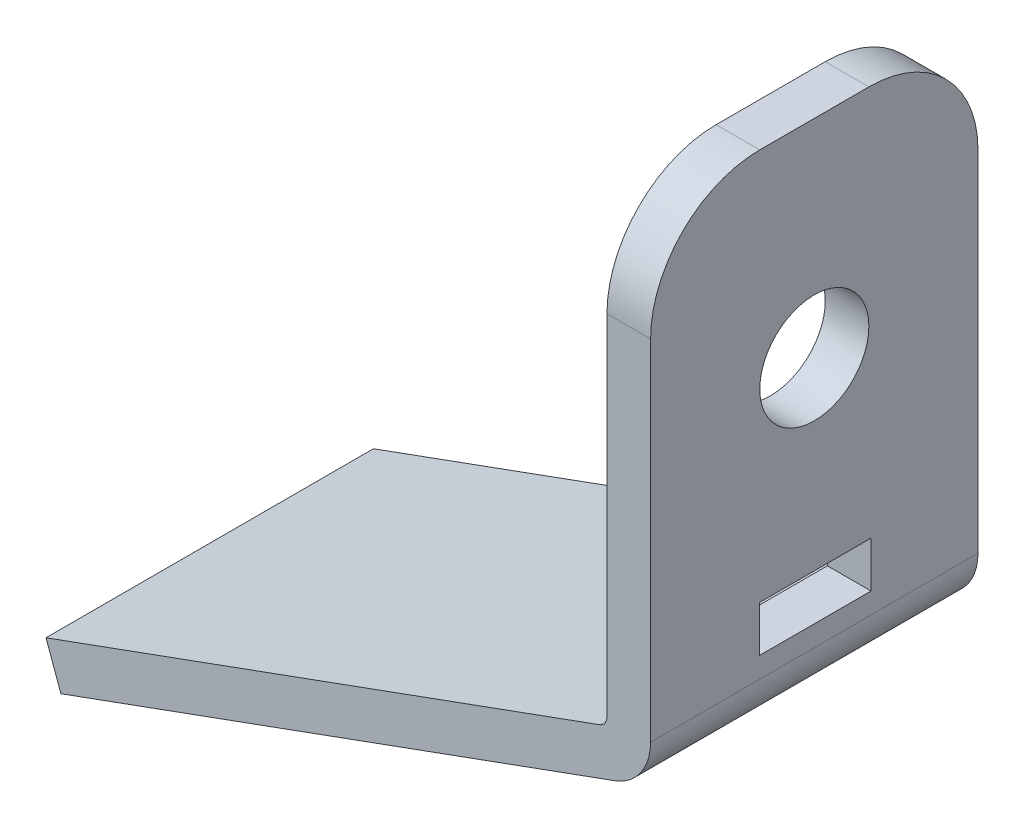
ISO-10303-21;
HEADER;
FILE_DESCRIPTION(('STEP AP214'),'2;1');
FILE_NAME('part.step','',(''),(''),'','','');
FILE_SCHEMA(('AUTOMOTIVE_DESIGN { 1 0 10303 214 1 1 1 1 }'));
ENDSEC;
DATA;
#1=APPLICATION_CONTEXT('core data for automotive mechanical design processes');
#2=APPLICATION_PROTOCOL_DEFINITION('international standard','automotive_design',2000,#1);
#3=PRODUCT_CONTEXT('',#1,'mechanical');
#4=PRODUCT('Part','Part','',(#3));
#5=PRODUCT_RELATED_PRODUCT_CATEGORY('part','',(#4));
#6=PRODUCT_DEFINITION_FORMATION('','',#4);
#7=PRODUCT_DEFINITION_CONTEXT('part definition',#1,'design');
#8=PRODUCT_DEFINITION('design','',#6,#7);
#9=PRODUCT_DEFINITION_SHAPE('','',#8);
#10=(LENGTH_UNIT() NAMED_UNIT(*) SI_UNIT(.MILLI.,.METRE.));
#11=(NAMED_UNIT(*) PLANE_ANGLE_UNIT() SI_UNIT($,.RADIAN.));
#12=(NAMED_UNIT(*) SI_UNIT($,.STERADIAN.) SOLID_ANGLE_UNIT());
#13=UNCERTAINTY_MEASURE_WITH_UNIT(LENGTH_MEASURE(1.E-05),#10,'distance_accuracy_value','');
#14=(GEOMETRIC_REPRESENTATION_CONTEXT(3) GLOBAL_UNCERTAINTY_ASSIGNED_CONTEXT((#13)) GLOBAL_UNIT_ASSIGNED_CONTEXT((#10,
#11,#12)) REPRESENTATION_CONTEXT('',''));
#15=CARTESIAN_POINT('',(0.,0.,0.));
#16=DIRECTION('',(0.,0.,1.));
#17=DIRECTION('',(1.,0.,0.));
#18=AXIS2_PLACEMENT_3D('',#15,#16,#17);
#19=CARTESIAN_POINT('',(2.00000000000001,-376.322980187255,-15.));
#20=DIRECTION('',(1.,0.,0.));
#21=DIRECTION('',(0.,0.,-1.));
#22=AXIS2_PLACEMENT_3D('',#19,#20,#21);
#23=PLANE('',#22);
#24=DIRECTION('',(0.,0.,-1.));
#25=VECTOR('',#24,1.);
#26=CARTESIAN_POINT('',(2.00000000000001,-375.372980187255,-10.1));
#27=LINE('',#26,#25);
#28=CARTESIAN_POINT('',(2.00000000000001,-375.372980187255,-5.));
#29=VERTEX_POINT('',#28);
#30=CARTESIAN_POINT('',(2.00000000000001,-375.372980187255,-10.1));
#31=VERTEX_POINT('',#30);
#32=EDGE_CURVE('E157',#29,#31,#27,.T.);
#33=ORIENTED_EDGE('',*,*,#32,.F.);
#34=DIRECTION('',(0.,-1.,0.));
#35=VECTOR('',#34,1.);
#36=CARTESIAN_POINT('',(2.00000000000001,-373.272980187255,-5.));
#37=LINE('',#36,#35);
#38=CARTESIAN_POINT('',(2.00000000000001,-373.272980187255,-5.));
#39=VERTEX_POINT('',#38);
#40=EDGE_CURVE('E161',#39,#29,#37,.T.);
#41=ORIENTED_EDGE('',*,*,#40,.F.);
#42=DIRECTION('',(0.,0.,1.));
#43=VECTOR('',#42,1.);
#44=CARTESIAN_POINT('',(2.00000000000001,-373.272980187255,-10.1));
#45=LINE('',#44,#43);
#46=CARTESIAN_POINT('',(2.00000000000001,-373.272980187255,-10.1));
#47=VERTEX_POINT('',#46);
#48=EDGE_CURVE('E141',#47,#39,#45,.T.);
#49=ORIENTED_EDGE('',*,*,#48,.F.);
#50=DIRECTION('',(0.,1.,0.));
#51=VECTOR('',#50,1.);
#52=CARTESIAN_POINT('',(2.00000000000001,-375.372980187255,-10.1));
#53=LINE('',#52,#51);
#54=EDGE_CURVE('E152',#31,#47,#53,.T.);
#55=ORIENTED_EDGE('',*,*,#54,.F.);
#56=EDGE_LOOP('',(#33,#41,#49,#55));
#57=FACE_BOUND('',#56,.T.);
#58=CARTESIAN_POINT('',(2.00000000000001,-364.820100819106,-7.5));
#59=DIRECTION('',(1.,0.,0.));
#60=DIRECTION('',(0.,0.,-1.));
#61=AXIS2_PLACEMENT_3D('',#58,#59,#60);
#62=CIRCLE('',#61,2.5);
#63=CARTESIAN_POINT('',(2.00000000000001,-364.820100819106,-10.));
#64=VERTEX_POINT('',#63);
#65=EDGE_CURVE('E168',#64,#64,#62,.T.);
#66=ORIENTED_EDGE('',*,*,#65,.F.);
#67=EDGE_LOOP('',(#66));
#68=FACE_BOUND('',#67,.T.);
#69=DIRECTION('',(0.,0.,1.));
#70=VECTOR('',#69,1.);
#71=CARTESIAN_POINT('',(2.00000000000001,-355.320100819106,-15.));
#72=LINE('',#71,#70);
#73=CARTESIAN_POINT('',(2.00000000000001,-355.320100819106,-10.));
#74=VERTEX_POINT('',#73);
#75=CARTESIAN_POINT('',(2.00000000000001,-355.320100819106,-5.));
#76=VERTEX_POINT('',#75);
#77=EDGE_CURVE('E194',#74,#76,#72,.T.);
#78=ORIENTED_EDGE('',*,*,#77,.T.);
#79=CARTESIAN_POINT('',(2.00000000000001,-360.320100819106,-5.));
#80=DIRECTION('',(1.,0.,0.));
#81=DIRECTION('',(0.,0.,-1.));
#82=AXIS2_PLACEMENT_3D('',#79,#80,#81);
#83=CIRCLE('',#82,5.);
#84=CARTESIAN_POINT('',(2.00000000000001,-360.320100819106,0.));
#85=VERTEX_POINT('',#84);
#86=EDGE_CURVE('E42',#76,#85,#83,.T.);
#87=ORIENTED_EDGE('',*,*,#86,.T.);
#88=DIRECTION('',(0.,1.,0.));
#89=VECTOR('',#88,1.);
#90=CARTESIAN_POINT('',(2.00000000000001,-376.322980187255,0.));
#91=LINE('',#90,#89);
#92=CARTESIAN_POINT('',(2.00000000000002,-376.322980187255,0.));
#93=VERTEX_POINT('',#92);
#94=EDGE_CURVE('E177',#93,#85,#91,.T.);
#95=ORIENTED_EDGE('',*,*,#94,.F.);
#96=DIRECTION('',(0.,0.,1.));
#97=VECTOR('',#96,1.);
#98=CARTESIAN_POINT('',(2.00000000000002,-376.322980187255,-15.));
#99=LINE('',#98,#97);
#100=CARTESIAN_POINT('',(2.00000000000002,-376.322980187255,-15.));
#101=VERTEX_POINT('',#100);
#102=EDGE_CURVE('E214',#101,#93,#99,.T.);
#103=ORIENTED_EDGE('',*,*,#102,.F.);
#104=DIRECTION('',(0.,1.,0.));
#105=VECTOR('',#104,1.);
#106=CARTESIAN_POINT('',(2.00000000000001,-375.320100819106,-15.));
#107=LINE('',#106,#105);
#108=CARTESIAN_POINT('',(2.00000000000001,-360.320100819106,-15.));
#109=VERTEX_POINT('',#108);
#110=EDGE_CURVE('E174',#101,#109,#107,.T.);
#111=ORIENTED_EDGE('',*,*,#110,.T.);
#112=CARTESIAN_POINT('',(2.00000000000001,-360.320100819106,-10.));
#113=DIRECTION('',(1.,0.,0.));
#114=DIRECTION('',(0.,0.,-1.));
#115=AXIS2_PLACEMENT_3D('',#112,#113,#114);
#116=CIRCLE('',#115,5.);
#117=EDGE_CURVE('E250',#109,#74,#116,.T.);
#118=ORIENTED_EDGE('',*,*,#117,.T.);
#119=EDGE_LOOP('',(#78,#87,#95,#103,#111,#118));
#120=FACE_BOUND('',#119,.T.);
#121=ADVANCED_FACE('F34',(#57,#68,#120),#23,.T.);
#122=CARTESIAN_POINT('',(-0.499999999999992,-376.322980187255,-15.));
#123=DIRECTION('',(0.,0.,1.));
#124=DIRECTION('',(1.,0.,0.));
#125=AXIS2_PLACEMENT_3D('',#122,#123,#124);
#126=CYLINDRICAL_SURFACE('',#125,2.50000000000002);
#127=CARTESIAN_POINT('',(-0.499999999999992,-376.322980187255,0.));
#128=DIRECTION('',(0.,0.,1.));
#129=DIRECTION('',(1.,0.,0.));
#130=AXIS2_PLACEMENT_3D('',#127,#128,#129);
#131=CIRCLE('',#130,2.50000000000002);
#132=CARTESIAN_POINT('',(0.355050358314159,-378.67221173922,0.));
#133=VERTEX_POINT('',#132);
#134=EDGE_CURVE('E209',#133,#93,#131,.T.);
#135=ORIENTED_EDGE('',*,*,#134,.F.);
#136=DIRECTION('',(0.,0.,1.));
#137=VECTOR('',#136,1.);
#138=CARTESIAN_POINT('',(0.355050358314159,-378.67221173922,-15.));
#139=LINE('',#138,#137);
#140=CARTESIAN_POINT('',(0.355050358314159,-378.67221173922,-15.));
#141=VERTEX_POINT('',#140);
#142=EDGE_CURVE('E217',#141,#133,#139,.T.);
#143=ORIENTED_EDGE('',*,*,#142,.F.);
#144=CARTESIAN_POINT('',(-0.499999999999992,-376.322980187255,-15.));
#145=DIRECTION('',(0.,0.,1.));
#146=DIRECTION('',(1.,0.,0.));
#147=AXIS2_PLACEMENT_3D('',#144,#145,#146);
#148=CIRCLE('',#147,2.50000000000002);
#149=EDGE_CURVE('E191',#141,#101,#148,.T.);
#150=ORIENTED_EDGE('',*,*,#149,.T.);
#151=ORIENTED_EDGE('',*,*,#102,.T.);
#152=EDGE_LOOP('',(#135,#143,#150,#151));
#153=FACE_BOUND('',#152,.T.);
#154=ADVANCED_FACE('F289',(#153),#126,.T.);
#155=CARTESIAN_POINT('',(0.355050358314159,-378.67221173922,-15.));
#156=DIRECTION('',(0.342020143325658,-0.939692620785912,0.));
#157=DIRECTION('',(0.939692620785912,0.342020143325658,0.));
#158=AXIS2_PLACEMENT_3D('',#155,#156,#157);
#159=PLANE('',#158);
#160=DIRECTION('',(0.939692620785912,0.342020143325658,0.));
#161=VECTOR('',#160,1.);
#162=CARTESIAN_POINT('',(0.355050358314159,-378.67221173922,0.));
#163=LINE('',#162,#161);
#164=CARTESIAN_POINT('',(-25.0166504029055,-387.906755609013,0.));
#165=VERTEX_POINT('',#164);
#166=EDGE_CURVE('E206',#165,#133,#163,.T.);
#167=ORIENTED_EDGE('',*,*,#166,.F.);
#168=DIRECTION('',(0.,0.,1.));
#169=VECTOR('',#168,1.);
#170=CARTESIAN_POINT('',(-25.0166504029055,-387.906755609013,-15.));
#171=LINE('',#170,#169);
#172=CARTESIAN_POINT('',(-25.0166504029055,-387.906755609013,-15.));
#173=VERTEX_POINT('',#172);
#174=EDGE_CURVE('E219',#173,#165,#171,.T.);
#175=ORIENTED_EDGE('',*,*,#174,.F.);
#176=DIRECTION('',(0.939692620785912,0.342020143325658,0.));
#177=VECTOR('',#176,1.);
#178=CARTESIAN_POINT('',(0.355050358314159,-378.67221173922,-15.));
#179=LINE('',#178,#177);
#180=EDGE_CURVE('E188',#173,#141,#179,.T.);
#181=ORIENTED_EDGE('',*,*,#180,.T.);
#182=ORIENTED_EDGE('',*,*,#142,.T.);
#183=EDGE_LOOP('',(#167,#175,#181,#182));
#184=FACE_BOUND('',#183,.T.);
#185=ADVANCED_FACE('F286',(#184),#159,.T.);
#186=CARTESIAN_POINT('',(-25.0166504029055,-387.906755609013,-15.));
#187=DIRECTION('',(-0.939692620785913,-0.342020143325657,0.));
#188=DIRECTION('',(0.342020143325657,-0.939692620785913,0.));
#189=AXIS2_PLACEMENT_3D('',#186,#187,#188);
#190=PLANE('',#189);
#191=DIRECTION('',(0.342020143325657,-0.939692620785913,0.));
#192=VECTOR('',#191,1.);
#193=CARTESIAN_POINT('',(-25.0166504029055,-387.906755609013,0.));
#194=LINE('',#193,#192);
#195=CARTESIAN_POINT('',(-25.7006906895567,-386.027370367441,0.));
#196=VERTEX_POINT('',#195);
#197=EDGE_CURVE('E203',#196,#165,#194,.T.);
#198=ORIENTED_EDGE('',*,*,#197,.F.);
#199=DIRECTION('',(0.,0.,1.));
#200=VECTOR('',#199,1.);
#201=CARTESIAN_POINT('',(-25.7006906895567,-386.027370367441,-15.));
#202=LINE('',#201,#200);
#203=CARTESIAN_POINT('',(-25.7006906895567,-386.027370367441,-15.));
#204=VERTEX_POINT('',#203);
#205=EDGE_CURVE('E221',#204,#196,#202,.T.);
#206=ORIENTED_EDGE('',*,*,#205,.F.);
#207=DIRECTION('',(0.342020143325657,-0.939692620785913,0.));
#208=VECTOR('',#207,1.);
#209=CARTESIAN_POINT('',(-25.0166504029055,-387.906755609013,-15.));
#210=LINE('',#209,#208);
#211=EDGE_CURVE('E185',#204,#173,#210,.T.);
#212=ORIENTED_EDGE('',*,*,#211,.T.);
#213=ORIENTED_EDGE('',*,*,#174,.T.);
#214=EDGE_LOOP('',(#198,#206,#212,#213));
#215=FACE_BOUND('',#214,.T.);
#216=ADVANCED_FACE('F282',(#215),#190,.T.);
#217=CARTESIAN_POINT('',(-0.328989928337184,-376.792826497648,-15.));
#218=DIRECTION('',(-0.342020143325669,0.939692620785908,0.));
#219=DIRECTION('',(-0.939692620785908,-0.342020143325669,0.));
#220=AXIS2_PLACEMENT_3D('',#217,#218,#219);
#221=PLANE('',#220);
#222=DIRECTION('',(-0.939692620785908,-0.342020143325669,0.));
#223=VECTOR('',#222,1.);
#224=CARTESIAN_POINT('',(-0.328989928337184,-376.792826497648,0.));
#225=LINE('',#224,#223);
#226=CARTESIAN_POINT('',(-0.328989928337175,-376.792826497648,0.));
#227=VERTEX_POINT('',#226);
#228=EDGE_CURVE('E200',#227,#196,#225,.T.);
#229=ORIENTED_EDGE('',*,*,#228,.F.);
#230=DIRECTION('',(0.,0.,1.));
#231=VECTOR('',#230,1.);
#232=CARTESIAN_POINT('',(-0.328989928337175,-376.792826497648,-15.));
#233=LINE('',#232,#231);
#234=CARTESIAN_POINT('',(-0.328989928337175,-376.792826497648,-15.));
#235=VERTEX_POINT('',#234);
#236=EDGE_CURVE('E223',#235,#227,#233,.T.);
#237=ORIENTED_EDGE('',*,*,#236,.F.);
#238=DIRECTION('',(-0.939692620785908,-0.342020143325669,0.));
#239=VECTOR('',#238,1.);
#240=CARTESIAN_POINT('',(-0.328989928337184,-376.792826497648,-15.));
#241=LINE('',#240,#239);
#242=EDGE_CURVE('E182',#235,#204,#241,.T.);
#243=ORIENTED_EDGE('',*,*,#242,.T.);
#244=ORIENTED_EDGE('',*,*,#205,.T.);
#245=EDGE_LOOP('',(#229,#237,#243,#244));
#246=FACE_BOUND('',#245,.T.);
#247=ADVANCED_FACE('F280',(#246),#221,.T.);
#248=CARTESIAN_POINT('',(-0.5,-376.322980187255,-15.));
#249=DIRECTION('',(0.,0.,1.));
#250=DIRECTION('',(1.,0.,0.));
#251=AXIS2_PLACEMENT_3D('',#248,#249,#250);
#252=CYLINDRICAL_SURFACE('',#251,0.499999999999985);
#253=CARTESIAN_POINT('',(-0.5,-376.322980187255,0.));
#254=DIRECTION('',(0.,0.,-1.));
#255=DIRECTION('',(-1.,0.,0.));
#256=AXIS2_PLACEMENT_3D('',#253,#254,#255);
#257=CIRCLE('',#256,0.499999999999985);
#258=CARTESIAN_POINT('',(0.,-376.322980187255,0.));
#259=VERTEX_POINT('',#258);
#260=EDGE_CURVE('E197',#259,#227,#257,.T.);
#261=ORIENTED_EDGE('',*,*,#260,.F.);
#262=DIRECTION('',(0.,0.,1.));
#263=VECTOR('',#262,1.);
#264=CARTESIAN_POINT('',(0.,-376.322980187255,-15.));
#265=LINE('',#264,#263);
#266=CARTESIAN_POINT('',(0.,-376.322980187255,-15.));
#267=VERTEX_POINT('',#266);
#268=EDGE_CURVE('E225',#267,#259,#265,.T.);
#269=ORIENTED_EDGE('',*,*,#268,.F.);
#270=CARTESIAN_POINT('',(-0.5,-376.322980187255,-15.));
#271=DIRECTION('',(0.,0.,-1.));
#272=DIRECTION('',(-1.,0.,0.));
#273=AXIS2_PLACEMENT_3D('',#270,#271,#272);
#274=CIRCLE('',#273,0.499999999999985);
#275=EDGE_CURVE('E179',#267,#235,#274,.T.);
#276=ORIENTED_EDGE('',*,*,#275,.T.);
#277=ORIENTED_EDGE('',*,*,#236,.T.);
#278=EDGE_LOOP('',(#261,#269,#276,#277));
#279=FACE_BOUND('',#278,.T.);
#280=ADVANCED_FACE('F276',(#279),#252,.F.);
#281=CARTESIAN_POINT('',(0.,-375.320100819106,-15.));
#282=DIRECTION('',(-1.,0.,0.));
#283=DIRECTION('',(0.,-1.,0.));
#284=AXIS2_PLACEMENT_3D('',#281,#282,#283);
#285=PLANE('',#284);
#286=DIRECTION('',(0.,0.,1.));
#287=VECTOR('',#286,1.);
#288=CARTESIAN_POINT('',(0.,-375.372980187255,-15.));
#289=LINE('',#288,#287);
#290=CARTESIAN_POINT('',(0.,-375.372980187255,-10.1));
#291=VERTEX_POINT('',#290);
#292=CARTESIAN_POINT('',(0.,-375.372980187255,-5.));
#293=VERTEX_POINT('',#292);
#294=EDGE_CURVE('E237',#291,#293,#289,.T.);
#295=ORIENTED_EDGE('',*,*,#294,.F.);
#296=DIRECTION('',(0.,-1.,0.));
#297=VECTOR('',#296,1.);
#298=CARTESIAN_POINT('',(0.,-375.320100819106,-10.1));
#299=LINE('',#298,#297);
#300=CARTESIAN_POINT('',(0.,-373.272980187255,-10.1));
#301=VERTEX_POINT('',#300);
#302=EDGE_CURVE('E216',#301,#291,#299,.T.);
#303=ORIENTED_EDGE('',*,*,#302,.F.);
#304=DIRECTION('',(0.,0.,-1.));
#305=VECTOR('',#304,1.);
#306=CARTESIAN_POINT('',(0.,-373.272980187255,-15.));
#307=LINE('',#306,#305);
#308=CARTESIAN_POINT('',(0.,-373.272980187255,-5.));
#309=VERTEX_POINT('',#308);
#310=EDGE_CURVE('E144',#309,#301,#307,.T.);
#311=ORIENTED_EDGE('',*,*,#310,.F.);
#312=DIRECTION('',(0.,1.,0.));
#313=VECTOR('',#312,1.);
#314=CARTESIAN_POINT('',(0.,-375.320100819106,-5.));
#315=LINE('',#314,#313);
#316=EDGE_CURVE('E235',#293,#309,#315,.T.);
#317=ORIENTED_EDGE('',*,*,#316,.F.);
#318=EDGE_LOOP('',(#295,#303,#311,#317));
#319=FACE_BOUND('',#318,.T.);
#320=CARTESIAN_POINT('',(0.,-364.820100819106,-7.5));
#321=DIRECTION('',(-1.,0.,0.));
#322=DIRECTION('',(0.,-1.,0.));
#323=AXIS2_PLACEMENT_3D('',#320,#321,#322);
#324=CIRCLE('',#323,2.5);
#325=CARTESIAN_POINT('',(0.,-367.320100819106,-7.5));
#326=VERTEX_POINT('',#325);
#327=EDGE_CURVE('E173',#326,#326,#324,.T.);
#328=ORIENTED_EDGE('',*,*,#327,.F.);
#329=EDGE_LOOP('',(#328));
#330=FACE_BOUND('',#329,.T.);
#331=DIRECTION('',(0.,-1.,0.));
#332=VECTOR('',#331,1.);
#333=CARTESIAN_POINT('',(0.,-375.320100819106,0.));
#334=LINE('',#333,#332);
#335=CARTESIAN_POINT('',(0.,-360.320100819106,0.));
#336=VERTEX_POINT('',#335);
#337=EDGE_CURVE('E195',#336,#259,#334,.T.);
#338=ORIENTED_EDGE('',*,*,#337,.F.);
#339=CARTESIAN_POINT('',(0.,-360.320100819106,-5.));
#340=DIRECTION('',(-1.,0.,0.));
#341=DIRECTION('',(0.,-1.,0.));
#342=AXIS2_PLACEMENT_3D('',#339,#340,#341);
#343=CIRCLE('',#342,5.);
#344=CARTESIAN_POINT('',(0.,-355.320100819106,-5.));
#345=VERTEX_POINT('',#344);
#346=EDGE_CURVE('E244',#336,#345,#343,.T.);
#347=ORIENTED_EDGE('',*,*,#346,.T.);
#348=DIRECTION('',(0.,0.,1.));
#349=VECTOR('',#348,1.);
#350=CARTESIAN_POINT('',(0.,-355.320100819106,-15.));
#351=LINE('',#350,#349);
#352=CARTESIAN_POINT('',(0.,-355.320100819106,-10.));
#353=VERTEX_POINT('',#352);
#354=EDGE_CURVE('E228',#353,#345,#351,.T.);
#355=ORIENTED_EDGE('',*,*,#354,.F.);
#356=CARTESIAN_POINT('',(0.,-360.320100819106,-10.));
#357=DIRECTION('',(-1.,0.,0.));
#358=DIRECTION('',(0.,-1.,0.));
#359=AXIS2_PLACEMENT_3D('',#356,#357,#358);
#360=CIRCLE('',#359,5.);
#361=CARTESIAN_POINT('',(0.,-360.320100819106,-15.));
#362=VERTEX_POINT('',#361);
#363=EDGE_CURVE('E242',#353,#362,#360,.T.);
#364=ORIENTED_EDGE('',*,*,#363,.T.);
#365=DIRECTION('',(0.,-1.,0.));
#366=VECTOR('',#365,1.);
#367=CARTESIAN_POINT('',(0.,-355.320100819106,-15.));
#368=LINE('',#367,#366);
#369=EDGE_CURVE('E176',#362,#267,#368,.T.);
#370=ORIENTED_EDGE('',*,*,#369,.T.);
#371=ORIENTED_EDGE('',*,*,#268,.T.);
#372=EDGE_LOOP('',(#338,#347,#355,#364,#370,#371));
#373=FACE_BOUND('',#372,.T.);
#374=ADVANCED_FACE('F264',(#319,#330,#373),#285,.T.);
#375=CARTESIAN_POINT('',(2.00000000000001,-355.320100819106,-15.));
#376=DIRECTION('',(0.,1.,0.));
#377=DIRECTION('',(0.,0.,1.));
#378=AXIS2_PLACEMENT_3D('',#375,#376,#377);
#379=PLANE('',#378);
#380=ORIENTED_EDGE('',*,*,#354,.T.);
#381=DIRECTION('',(-1.,0.,0.));
#382=VECTOR('',#381,1.);
#383=CARTESIAN_POINT('',(2.00000000000001,-355.320100819106,-5.));
#384=LINE('',#383,#382);
#385=EDGE_CURVE('E55',#345,#76,#384,.F.);
#386=ORIENTED_EDGE('',*,*,#385,.T.);
#387=ORIENTED_EDGE('',*,*,#77,.F.);
#388=DIRECTION('',(-1.,0.,0.));
#389=VECTOR('',#388,1.);
#390=CARTESIAN_POINT('',(2.00000000000001,-355.320100819106,-10.));
#391=LINE('',#390,#389);
#392=EDGE_CURVE('E246',#74,#353,#391,.T.);
#393=ORIENTED_EDGE('',*,*,#392,.T.);
#394=EDGE_LOOP('',(#380,#386,#387,#393));
#395=FACE_BOUND('',#394,.T.);
#396=ADVANCED_FACE('F265',(#395),#379,.T.);
#397=CARTESIAN_POINT('',(-0.5,-376.322980187255,-15.));
#398=DIRECTION('',(0.,0.,-1.));
#399=DIRECTION('',(-1.,0.,0.));
#400=AXIS2_PLACEMENT_3D('',#397,#398,#399);
#401=PLANE('',#400);
#402=ORIENTED_EDGE('',*,*,#369,.F.);
#403=DIRECTION('',(-1.,0.,0.));
#404=VECTOR('',#403,1.);
#405=CARTESIAN_POINT('',(-0.5,-360.320100819106,-15.));
#406=LINE('',#405,#404);
#407=EDGE_CURVE('E11',#362,#109,#406,.F.);
#408=ORIENTED_EDGE('',*,*,#407,.T.);
#409=ORIENTED_EDGE('',*,*,#110,.F.);
#410=ORIENTED_EDGE('',*,*,#149,.F.);
#411=ORIENTED_EDGE('',*,*,#180,.F.);
#412=ORIENTED_EDGE('',*,*,#211,.F.);
#413=ORIENTED_EDGE('',*,*,#242,.F.);
#414=ORIENTED_EDGE('',*,*,#275,.F.);
#415=EDGE_LOOP('',(#402,#408,#409,#410,#411,#412,#413,#414));
#416=FACE_BOUND('',#415,.T.);
#417=ADVANCED_FACE('F271',(#416),#401,.T.);
#418=CARTESIAN_POINT('',(-0.5,-376.322980187255,0.));
#419=DIRECTION('',(0.,0.,-1.));
#420=DIRECTION('',(-1.,0.,0.));
#421=AXIS2_PLACEMENT_3D('',#418,#419,#420);
#422=PLANE('',#421);
#423=ORIENTED_EDGE('',*,*,#94,.T.);
#424=DIRECTION('',(-1.,0.,0.));
#425=VECTOR('',#424,1.);
#426=CARTESIAN_POINT('',(0.,-360.320100819106,0.));
#427=LINE('',#426,#425);
#428=EDGE_CURVE('E239',#85,#336,#427,.T.);
#429=ORIENTED_EDGE('',*,*,#428,.T.);
#430=ORIENTED_EDGE('',*,*,#337,.T.);
#431=ORIENTED_EDGE('',*,*,#260,.T.);
#432=ORIENTED_EDGE('',*,*,#228,.T.);
#433=ORIENTED_EDGE('',*,*,#197,.T.);
#434=ORIENTED_EDGE('',*,*,#166,.T.);
#435=ORIENTED_EDGE('',*,*,#134,.T.);
#436=EDGE_LOOP('',(#423,#429,#430,#431,#432,#433,#434,#435));
#437=FACE_BOUND('',#436,.T.);
#438=ADVANCED_FACE('F258',(#437),#422,.F.);
#439=CARTESIAN_POINT('',(-13.,-364.820100819106,-7.5));
#440=DIRECTION('',(1.,0.,0.));
#441=DIRECTION('',(0.,0.,-1.));
#442=AXIS2_PLACEMENT_3D('',#439,#440,#441);
#443=CYLINDRICAL_SURFACE('',#442,2.5);
#444=ORIENTED_EDGE('',*,*,#327,.T.);
#445=EDGE_LOOP('',(#444));
#446=FACE_BOUND('',#445,.T.);
#447=ORIENTED_EDGE('',*,*,#65,.T.);
#448=EDGE_LOOP('',(#447));
#449=FACE_BOUND('',#448,.T.);
#450=ADVANCED_FACE('F326',(#446,#449),#443,.F.);
#451=CARTESIAN_POINT('',(-13.,-375.372980187255,-10.1));
#452=DIRECTION('',(0.,-1.,0.));
#453=DIRECTION('',(0.,0.,-1.));
#454=AXIS2_PLACEMENT_3D('',#451,#452,#453);
#455=PLANE('',#454);
#456=ORIENTED_EDGE('',*,*,#294,.T.);
#457=DIRECTION('',(1.,0.,0.));
#458=VECTOR('',#457,1.);
#459=CARTESIAN_POINT('',(-13.,-375.372980187255,-5.));
#460=LINE('',#459,#458);
#461=EDGE_CURVE('E166',#293,#29,#460,.T.);
#462=ORIENTED_EDGE('',*,*,#461,.T.);
#463=ORIENTED_EDGE('',*,*,#32,.T.);
#464=DIRECTION('',(1.,0.,0.));
#465=VECTOR('',#464,1.);
#466=CARTESIAN_POINT('',(-13.,-375.372980187255,-10.1));
#467=LINE('',#466,#465);
#468=EDGE_CURVE('E148',#291,#31,#467,.T.);
#469=ORIENTED_EDGE('',*,*,#468,.F.);
#470=EDGE_LOOP('',(#456,#462,#463,#469));
#471=FACE_BOUND('',#470,.T.);
#472=ADVANCED_FACE('F323',(#471),#455,.F.);
#473=CARTESIAN_POINT('',(-13.,-373.272980187255,-5.));
#474=DIRECTION('',(0.,0.,1.));
#475=DIRECTION('',(1.,0.,0.));
#476=AXIS2_PLACEMENT_3D('',#473,#474,#475);
#477=PLANE('',#476);
#478=ORIENTED_EDGE('',*,*,#316,.T.);
#479=DIRECTION('',(1.,0.,0.));
#480=VECTOR('',#479,1.);
#481=CARTESIAN_POINT('',(-13.,-373.272980187255,-5.));
#482=LINE('',#481,#480);
#483=EDGE_CURVE('E147',#309,#39,#482,.T.);
#484=ORIENTED_EDGE('',*,*,#483,.T.);
#485=ORIENTED_EDGE('',*,*,#40,.T.);
#486=ORIENTED_EDGE('',*,*,#461,.F.);
#487=EDGE_LOOP('',(#478,#484,#485,#486));
#488=FACE_BOUND('',#487,.T.);
#489=ADVANCED_FACE('F319',(#488),#477,.F.);
#490=CARTESIAN_POINT('',(-13.,-373.272980187255,-10.1));
#491=DIRECTION('',(0.,1.,0.));
#492=DIRECTION('',(0.,0.,1.));
#493=AXIS2_PLACEMENT_3D('',#490,#491,#492);
#494=PLANE('',#493);
#495=ORIENTED_EDGE('',*,*,#310,.T.);
#496=DIRECTION('',(1.,0.,0.));
#497=VECTOR('',#496,1.);
#498=CARTESIAN_POINT('',(-13.,-373.272980187255,-10.1));
#499=LINE('',#498,#497);
#500=EDGE_CURVE('E136',#301,#47,#499,.T.);
#501=ORIENTED_EDGE('',*,*,#500,.T.);
#502=ORIENTED_EDGE('',*,*,#48,.T.);
#503=ORIENTED_EDGE('',*,*,#483,.F.);
#504=EDGE_LOOP('',(#495,#501,#502,#503));
#505=FACE_BOUND('',#504,.T.);
#506=ADVANCED_FACE('F138',(#505),#494,.F.);
#507=CARTESIAN_POINT('',(-13.,-375.372980187255,-10.1));
#508=DIRECTION('',(0.,0.,-1.));
#509=DIRECTION('',(-1.,0.,0.));
#510=AXIS2_PLACEMENT_3D('',#507,#508,#509);
#511=PLANE('',#510);
#512=ORIENTED_EDGE('',*,*,#302,.T.);
#513=ORIENTED_EDGE('',*,*,#468,.T.);
#514=ORIENTED_EDGE('',*,*,#54,.T.);
#515=ORIENTED_EDGE('',*,*,#500,.F.);
#516=EDGE_LOOP('',(#512,#513,#514,#515));
#517=FACE_BOUND('',#516,.T.);
#518=ADVANCED_FACE('F153',(#517),#511,.F.);
#519=CARTESIAN_POINT('',(-0.5,-360.320100819106,-5.));
#520=DIRECTION('',(1.,0.,0.));
#521=DIRECTION('',(0.,0.,-1.));
#522=AXIS2_PLACEMENT_3D('',#519,#520,#521);
#523=CYLINDRICAL_SURFACE('',#522,5.);
#524=ORIENTED_EDGE('',*,*,#86,.F.);
#525=ORIENTED_EDGE('',*,*,#385,.F.);
#526=ORIENTED_EDGE('',*,*,#346,.F.);
#527=ORIENTED_EDGE('',*,*,#428,.F.);
#528=EDGE_LOOP('',(#524,#525,#526,#527));
#529=FACE_BOUND('',#528,.T.);
#530=ADVANCED_FACE('F261',(#529),#523,.T.);
#531=CARTESIAN_POINT('',(2.00000000000001,-360.320100819106,-10.));
#532=DIRECTION('',(-1.,0.,0.));
#533=DIRECTION('',(0.,0.,1.));
#534=AXIS2_PLACEMENT_3D('',#531,#532,#533);
#535=CYLINDRICAL_SURFACE('',#534,5.);
#536=ORIENTED_EDGE('',*,*,#117,.F.);
#537=ORIENTED_EDGE('',*,*,#407,.F.);
#538=ORIENTED_EDGE('',*,*,#363,.F.);
#539=ORIENTED_EDGE('',*,*,#392,.F.);
#540=EDGE_LOOP('',(#536,#537,#538,#539));
#541=FACE_BOUND('',#540,.T.);
#542=ADVANCED_FACE('F36',(#541),#535,.T.);
#543=CLOSED_SHELL('',(#121,#154,#185,#216,#247,#280,#374,#396,#417,#438,#450,#472,#489,#506,
#518,#530,#542));
#544=MANIFOLD_SOLID_BREP('B2',#543);
#545=ADVANCED_BREP_SHAPE_REPRESENTATION('',(#18,#544),#14);
#546=SHAPE_DEFINITION_REPRESENTATION(#9,#545);
ENDSEC;
END-ISO-10303-21;
